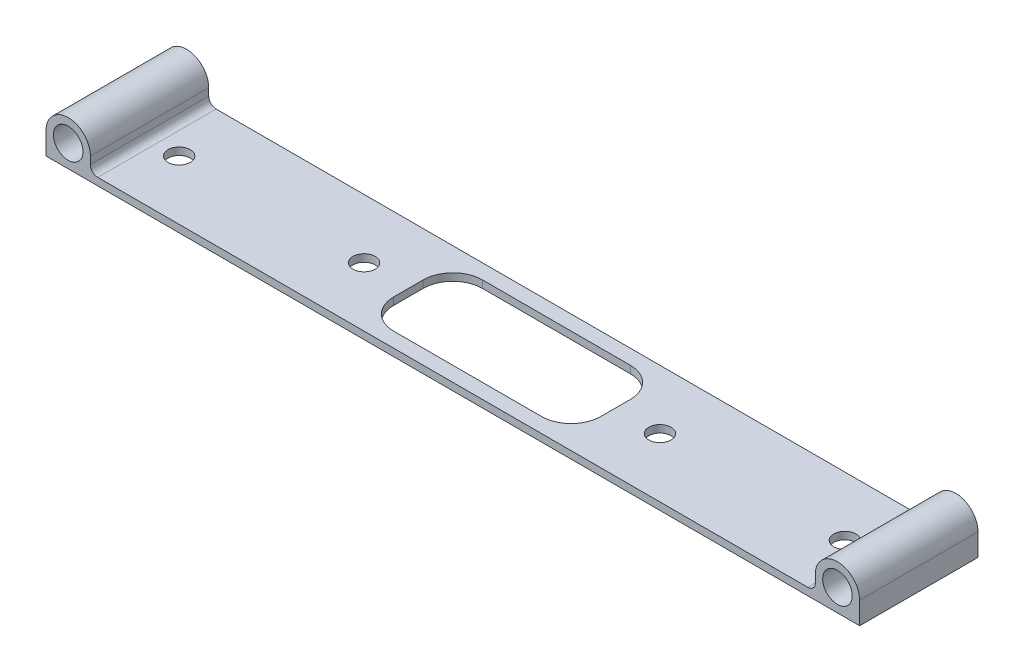
ISO-10303-21;
HEADER;
FILE_DESCRIPTION(('STEP AP214'),'2;1');
FILE_NAME('part.step','',(''),(''),'','','');
FILE_SCHEMA(('AUTOMOTIVE_DESIGN { 1 0 10303 214 1 1 1 1 }'));
ENDSEC;
DATA;
#1=APPLICATION_CONTEXT('core data for automotive mechanical design processes');
#2=APPLICATION_PROTOCOL_DEFINITION('international standard','automotive_design',2000,#1);
#3=PRODUCT_CONTEXT('',#1,'mechanical');
#4=PRODUCT('Part','Part','',(#3));
#5=PRODUCT_RELATED_PRODUCT_CATEGORY('part','',(#4));
#6=PRODUCT_DEFINITION_FORMATION('','',#4);
#7=PRODUCT_DEFINITION_CONTEXT('part definition',#1,'design');
#8=PRODUCT_DEFINITION('design','',#6,#7);
#9=PRODUCT_DEFINITION_SHAPE('','',#8);
#10=(LENGTH_UNIT() NAMED_UNIT(*) SI_UNIT(.MILLI.,.METRE.));
#11=(NAMED_UNIT(*) PLANE_ANGLE_UNIT() SI_UNIT($,.RADIAN.));
#12=(NAMED_UNIT(*) SI_UNIT($,.STERADIAN.) SOLID_ANGLE_UNIT());
#13=UNCERTAINTY_MEASURE_WITH_UNIT(LENGTH_MEASURE(1.E-05),#10,'distance_accuracy_value','');
#14=(GEOMETRIC_REPRESENTATION_CONTEXT(3) GLOBAL_UNCERTAINTY_ASSIGNED_CONTEXT((#13)) GLOBAL_UNIT_ASSIGNED_CONTEXT((#10,
#11,#12)) REPRESENTATION_CONTEXT('',''));
#15=CARTESIAN_POINT('',(0.,0.,0.));
#16=DIRECTION('',(0.,0.,1.));
#17=DIRECTION('',(1.,0.,0.));
#18=AXIS2_PLACEMENT_3D('',#15,#16,#17);
#19=CARTESIAN_POINT('',(-9.525,0.,50.8));
#20=DIRECTION('',(1.,0.,0.));
#21=DIRECTION('',(0.,1.,0.));
#22=AXIS2_PLACEMENT_3D('',#19,#20,#21);
#23=PLANE('',#22);
#24=DIRECTION('',(0.,-1.,0.));
#25=VECTOR('',#24,1.);
#26=CARTESIAN_POINT('',(-9.525,0.,0.));
#27=LINE('',#26,#25);
#28=CARTESIAN_POINT('',(-9.525,0.,0.));
#29=VERTEX_POINT('',#28);
#30=CARTESIAN_POINT('',(-9.525,-9.525,0.));
#31=VERTEX_POINT('',#30);
#32=EDGE_CURVE('E264',#29,#31,#27,.T.);
#33=ORIENTED_EDGE('',*,*,#32,.T.);
#34=DIRECTION('',(0.,0.,-1.));
#35=VECTOR('',#34,1.);
#36=CARTESIAN_POINT('',(-9.525,-9.525,50.8));
#37=LINE('',#36,#35);
#38=CARTESIAN_POINT('',(-9.525,-9.525,50.8));
#39=VERTEX_POINT('',#38);
#40=EDGE_CURVE('E286',#39,#31,#37,.T.);
#41=ORIENTED_EDGE('',*,*,#40,.F.);
#42=DIRECTION('',(0.,-1.,0.));
#43=VECTOR('',#42,1.);
#44=CARTESIAN_POINT('',(-9.525,0.,50.8));
#45=LINE('',#44,#43);
#46=CARTESIAN_POINT('',(-9.525,0.,50.8));
#47=VERTEX_POINT('',#46);
#48=EDGE_CURVE('E242',#47,#39,#45,.T.);
#49=ORIENTED_EDGE('',*,*,#48,.F.);
#50=DIRECTION('',(0.,0.,-1.));
#51=VECTOR('',#50,1.);
#52=CARTESIAN_POINT('',(-9.525,0.,50.8));
#53=LINE('',#52,#51);
#54=EDGE_CURVE('E260',#47,#29,#53,.T.);
#55=ORIENTED_EDGE('',*,*,#54,.T.);
#56=EDGE_LOOP('',(#33,#41,#49,#55));
#57=FACE_BOUND('',#56,.T.);
#58=ADVANCED_FACE('F41',(#57),#23,.F.);
#59=CARTESIAN_POINT('',(0.,-9.52500000000001,50.8));
#60=DIRECTION('',(0.,1.,0.));
#61=DIRECTION('',(-1.,0.,0.));
#62=AXIS2_PLACEMENT_3D('',#59,#60,#61);
#63=PLANE('',#62);
#64=DIRECTION('',(1.,0.,0.));
#65=VECTOR('',#64,1.);
#66=CARTESIAN_POINT('',(0.,-9.52500000000029,6.35));
#67=LINE('',#66,#65);
#68=CARTESIAN_POINT('',(133.35,-9.52500000000029,6.35));
#69=VERTEX_POINT('',#68);
#70=CARTESIAN_POINT('',(196.85,-9.52500000000029,6.35));
#71=VERTEX_POINT('',#70);
#72=EDGE_CURVE('E731',#69,#71,#67,.T.);
#73=ORIENTED_EDGE('',*,*,#72,.F.);
#74=CARTESIAN_POINT('',(133.35,-9.52500000000013,19.05));
#75=DIRECTION('',(0.,1.,0.));
#76=DIRECTION('',(-1.,0.,0.));
#77=AXIS2_PLACEMENT_3D('',#74,#75,#76);
#78=CIRCLE('',#77,12.7);
#79=CARTESIAN_POINT('',(120.65,-9.52500000000029,19.05));
#80=VERTEX_POINT('',#79);
#81=EDGE_CURVE('E339',#69,#80,#78,.T.);
#82=ORIENTED_EDGE('',*,*,#81,.T.);
#83=DIRECTION('',(0.,0.,1.));
#84=VECTOR('',#83,1.);
#85=CARTESIAN_POINT('',(120.65,-9.52500000000029,0.));
#86=LINE('',#85,#84);
#87=CARTESIAN_POINT('',(120.65,-9.52500000000029,31.75));
#88=VERTEX_POINT('',#87);
#89=EDGE_CURVE('E737',#80,#88,#86,.T.);
#90=ORIENTED_EDGE('',*,*,#89,.T.);
#91=CARTESIAN_POINT('',(133.35,-9.52500000000013,31.75));
#92=DIRECTION('',(0.,1.,0.));
#93=DIRECTION('',(-1.,0.,0.));
#94=AXIS2_PLACEMENT_3D('',#91,#92,#93);
#95=CIRCLE('',#94,12.7);
#96=CARTESIAN_POINT('',(133.35,-9.52500000000029,44.45));
#97=VERTEX_POINT('',#96);
#98=EDGE_CURVE('E333',#88,#97,#95,.T.);
#99=ORIENTED_EDGE('',*,*,#98,.T.);
#100=DIRECTION('',(1.,0.,0.));
#101=VECTOR('',#100,1.);
#102=CARTESIAN_POINT('',(0.,-9.52500000000029,44.45));
#103=LINE('',#102,#101);
#104=CARTESIAN_POINT('',(196.85,-9.52500000000029,44.45));
#105=VERTEX_POINT('',#104);
#106=EDGE_CURVE('E757',#97,#105,#103,.T.);
#107=ORIENTED_EDGE('',*,*,#106,.T.);
#108=CARTESIAN_POINT('',(196.85,-9.52500000000019,31.75));
#109=DIRECTION('',(0.,1.,0.));
#110=DIRECTION('',(-1.,0.,0.));
#111=AXIS2_PLACEMENT_3D('',#108,#109,#110);
#112=CIRCLE('',#111,12.7);
#113=CARTESIAN_POINT('',(209.55,-9.52500000000029,31.75));
#114=VERTEX_POINT('',#113);
#115=EDGE_CURVE('E327',#105,#114,#112,.T.);
#116=ORIENTED_EDGE('',*,*,#115,.T.);
#117=DIRECTION('',(0.,0.,1.));
#118=VECTOR('',#117,1.);
#119=CARTESIAN_POINT('',(209.55,-9.52500000000029,0.));
#120=LINE('',#119,#118);
#121=CARTESIAN_POINT('',(209.55,-9.52500000000029,19.05));
#122=VERTEX_POINT('',#121);
#123=EDGE_CURVE('E753',#122,#114,#120,.T.);
#124=ORIENTED_EDGE('',*,*,#123,.F.);
#125=CARTESIAN_POINT('',(196.85,-9.52500000000019,19.05));
#126=DIRECTION('',(0.,1.,0.));
#127=DIRECTION('',(-1.,0.,0.));
#128=AXIS2_PLACEMENT_3D('',#125,#126,#127);
#129=CIRCLE('',#128,12.7);
#130=EDGE_CURVE('E321',#122,#71,#129,.T.);
#131=ORIENTED_EDGE('',*,*,#130,.T.);
#132=EDGE_LOOP('',(#73,#82,#90,#99,#107,#116,#124,#131));
#133=FACE_BOUND('',#132,.T.);
#134=CARTESIAN_POINT('',(307.975,-9.52500000000029,25.4));
#135=DIRECTION('',(0.,1.,0.));
#136=DIRECTION('',(-1.,0.,0.));
#137=AXIS2_PLACEMENT_3D('',#134,#135,#136);
#138=CIRCLE('',#137,4.76250000000001);
#139=CARTESIAN_POINT('',(303.2125,-9.52500000000029,25.4));
#140=VERTEX_POINT('',#139);
#141=EDGE_CURVE('E210',#140,#140,#138,.F.);
#142=ORIENTED_EDGE('',*,*,#141,.F.);
#143=EDGE_LOOP('',(#142));
#144=FACE_BOUND('',#143,.T.);
#145=CARTESIAN_POINT('',(228.6,-9.52500000000022,25.4));
#146=DIRECTION('',(0.,1.,0.));
#147=DIRECTION('',(-1.,0.,0.));
#148=AXIS2_PLACEMENT_3D('',#145,#146,#147);
#149=CIRCLE('',#148,4.76250000000001);
#150=CARTESIAN_POINT('',(223.8375,-9.52500000000021,25.4));
#151=VERTEX_POINT('',#150);
#152=EDGE_CURVE('E719',#151,#151,#149,.F.);
#153=ORIENTED_EDGE('',*,*,#152,.F.);
#154=EDGE_LOOP('',(#153));
#155=FACE_BOUND('',#154,.T.);
#156=CARTESIAN_POINT('',(22.225,-9.52500000000003,25.4));
#157=DIRECTION('',(0.,1.,0.));
#158=DIRECTION('',(-1.,0.,0.));
#159=AXIS2_PLACEMENT_3D('',#156,#157,#158);
#160=CIRCLE('',#159,4.76250000000001);
#161=CARTESIAN_POINT('',(17.4625,-9.52500000000003,25.4));
#162=VERTEX_POINT('',#161);
#163=EDGE_CURVE('E233',#162,#162,#160,.T.);
#164=ORIENTED_EDGE('',*,*,#163,.T.);
#165=EDGE_LOOP('',(#164));
#166=FACE_BOUND('',#165,.T.);
#167=CARTESIAN_POINT('',(101.6,-9.5250000000001,25.4));
#168=DIRECTION('',(0.,1.,0.));
#169=DIRECTION('',(-1.,0.,0.));
#170=AXIS2_PLACEMENT_3D('',#167,#168,#169);
#171=CIRCLE('',#170,4.76250000000001);
#172=CARTESIAN_POINT('',(96.8375,-9.5250000000001,25.4));
#173=VERTEX_POINT('',#172);
#174=EDGE_CURVE('E226',#173,#173,#171,.T.);
#175=ORIENTED_EDGE('',*,*,#174,.T.);
#176=EDGE_LOOP('',(#175));
#177=FACE_BOUND('',#176,.T.);
#178=DIRECTION('',(1.,0.,0.));
#179=VECTOR('',#178,1.);
#180=CARTESIAN_POINT('',(0.,-9.52500000000001,0.));
#181=LINE('',#180,#179);
#182=CARTESIAN_POINT('',(339.725,-9.525,0.));
#183=VERTEX_POINT('',#182);
#184=EDGE_CURVE('E268',#31,#183,#181,.T.);
#185=ORIENTED_EDGE('',*,*,#184,.T.);
#186=DIRECTION('',(0.,0.,-1.));
#187=VECTOR('',#186,1.);
#188=CARTESIAN_POINT('',(339.725,-9.525,50.8));
#189=LINE('',#188,#187);
#190=CARTESIAN_POINT('',(339.725,-9.525,50.8));
#191=VERTEX_POINT('',#190);
#192=EDGE_CURVE('E205',#191,#183,#189,.T.);
#193=ORIENTED_EDGE('',*,*,#192,.F.);
#194=DIRECTION('',(1.,0.,0.));
#195=VECTOR('',#194,1.);
#196=CARTESIAN_POINT('',(0.,-9.52500000000001,50.8));
#197=LINE('',#196,#195);
#198=EDGE_CURVE('E192',#39,#191,#197,.T.);
#199=ORIENTED_EDGE('',*,*,#198,.F.);
#200=ORIENTED_EDGE('',*,*,#40,.T.);
#201=EDGE_LOOP('',(#185,#193,#199,#200));
#202=FACE_BOUND('',#201,.T.);
#203=ADVANCED_FACE('F385',(#133,#144,#155,#166,#177,#202),#63,.F.);
#204=CARTESIAN_POINT('',(0.,-6.35,50.8));
#205=DIRECTION('',(0.,1.,0.));
#206=DIRECTION('',(-1.,0.,0.));
#207=AXIS2_PLACEMENT_3D('',#204,#205,#206);
#208=PLANE('',#207);
#209=DIRECTION('',(0.,0.,1.));
#210=VECTOR('',#209,1.);
#211=CARTESIAN_POINT('',(120.65,-6.35,0.));
#212=LINE('',#211,#210);
#213=CARTESIAN_POINT('',(120.65,-6.35,19.05));
#214=VERTEX_POINT('',#213);
#215=CARTESIAN_POINT('',(120.65,-6.35,31.75));
#216=VERTEX_POINT('',#215);
#217=EDGE_CURVE('E746',#214,#216,#212,.T.);
#218=ORIENTED_EDGE('',*,*,#217,.F.);
#219=CARTESIAN_POINT('',(133.35,-6.35,19.05));
#220=DIRECTION('',(0.,1.,0.));
#221=DIRECTION('',(-1.,0.,0.));
#222=AXIS2_PLACEMENT_3D('',#219,#220,#221);
#223=CIRCLE('',#222,12.7);
#224=CARTESIAN_POINT('',(133.35,-6.35,6.35));
#225=VERTEX_POINT('',#224);
#226=EDGE_CURVE('E336',#214,#225,#223,.F.);
#227=ORIENTED_EDGE('',*,*,#226,.T.);
#228=DIRECTION('',(1.,0.,0.));
#229=VECTOR('',#228,1.);
#230=CARTESIAN_POINT('',(0.,-6.35,6.35));
#231=LINE('',#230,#229);
#232=CARTESIAN_POINT('',(196.85,-6.35,6.35));
#233=VERTEX_POINT('',#232);
#234=EDGE_CURVE('E733',#225,#233,#231,.T.);
#235=ORIENTED_EDGE('',*,*,#234,.T.);
#236=CARTESIAN_POINT('',(196.85,-6.35,19.05));
#237=DIRECTION('',(0.,1.,0.));
#238=DIRECTION('',(-1.,0.,0.));
#239=AXIS2_PLACEMENT_3D('',#236,#237,#238);
#240=CIRCLE('',#239,12.7);
#241=CARTESIAN_POINT('',(209.55,-6.35,19.05));
#242=VERTEX_POINT('',#241);
#243=EDGE_CURVE('E318',#233,#242,#240,.F.);
#244=ORIENTED_EDGE('',*,*,#243,.T.);
#245=DIRECTION('',(0.,0.,1.));
#246=VECTOR('',#245,1.);
#247=CARTESIAN_POINT('',(209.55,-6.35,0.));
#248=LINE('',#247,#246);
#249=CARTESIAN_POINT('',(209.55,-6.35,31.75));
#250=VERTEX_POINT('',#249);
#251=EDGE_CURVE('E738',#242,#250,#248,.T.);
#252=ORIENTED_EDGE('',*,*,#251,.T.);
#253=CARTESIAN_POINT('',(196.85,-6.35,31.75));
#254=DIRECTION('',(0.,1.,0.));
#255=DIRECTION('',(-1.,0.,0.));
#256=AXIS2_PLACEMENT_3D('',#253,#254,#255);
#257=CIRCLE('',#256,12.7);
#258=CARTESIAN_POINT('',(196.85,-6.35,44.45));
#259=VERTEX_POINT('',#258);
#260=EDGE_CURVE('E324',#250,#259,#257,.F.);
#261=ORIENTED_EDGE('',*,*,#260,.T.);
#262=DIRECTION('',(1.,0.,0.));
#263=VECTOR('',#262,1.);
#264=CARTESIAN_POINT('',(0.,-6.35,44.45));
#265=LINE('',#264,#263);
#266=CARTESIAN_POINT('',(133.35,-6.35,44.45));
#267=VERTEX_POINT('',#266);
#268=EDGE_CURVE('E742',#267,#259,#265,.T.);
#269=ORIENTED_EDGE('',*,*,#268,.F.);
#270=CARTESIAN_POINT('',(133.35,-6.35,31.75));
#271=DIRECTION('',(0.,1.,0.));
#272=DIRECTION('',(-1.,0.,0.));
#273=AXIS2_PLACEMENT_3D('',#270,#271,#272);
#274=CIRCLE('',#273,12.7);
#275=EDGE_CURVE('E330',#267,#216,#274,.F.);
#276=ORIENTED_EDGE('',*,*,#275,.T.);
#277=EDGE_LOOP('',(#218,#227,#235,#244,#252,#261,#269,#276));
#278=FACE_BOUND('',#277,.T.);
#279=CARTESIAN_POINT('',(307.975,-6.35,25.4));
#280=DIRECTION('',(0.,-1.,0.));
#281=DIRECTION('',(1.,0.,0.));
#282=AXIS2_PLACEMENT_3D('',#279,#280,#281);
#283=CIRCLE('',#282,4.76250000000001);
#284=CARTESIAN_POINT('',(312.7375,-6.35,25.4));
#285=VERTEX_POINT('',#284);
#286=EDGE_CURVE('E722',#285,#285,#283,.T.);
#287=ORIENTED_EDGE('',*,*,#286,.T.);
#288=EDGE_LOOP('',(#287));
#289=FACE_BOUND('',#288,.T.);
#290=CARTESIAN_POINT('',(228.6,-6.35000000000001,25.4));
#291=DIRECTION('',(0.,-1.,0.));
#292=DIRECTION('',(1.,0.,0.));
#293=AXIS2_PLACEMENT_3D('',#290,#291,#292);
#294=CIRCLE('',#293,4.76250000000001);
#295=CARTESIAN_POINT('',(233.3625,-6.35000000000001,25.4));
#296=VERTEX_POINT('',#295);
#297=EDGE_CURVE('E716',#296,#296,#294,.T.);
#298=ORIENTED_EDGE('',*,*,#297,.T.);
#299=EDGE_LOOP('',(#298));
#300=FACE_BOUND('',#299,.T.);
#301=CARTESIAN_POINT('',(22.225,-6.35,25.4));
#302=DIRECTION('',(0.,1.,0.));
#303=DIRECTION('',(-1.,0.,0.));
#304=AXIS2_PLACEMENT_3D('',#301,#302,#303);
#305=CIRCLE('',#304,4.76250000000001);
#306=CARTESIAN_POINT('',(17.4625,-6.35,25.4));
#307=VERTEX_POINT('',#306);
#308=EDGE_CURVE('E222',#307,#307,#305,.T.);
#309=ORIENTED_EDGE('',*,*,#308,.F.);
#310=EDGE_LOOP('',(#309));
#311=FACE_BOUND('',#310,.T.);
#312=CARTESIAN_POINT('',(101.6,-6.35000000000001,25.4));
#313=DIRECTION('',(0.,1.,0.));
#314=DIRECTION('',(-1.,0.,0.));
#315=AXIS2_PLACEMENT_3D('',#312,#313,#314);
#316=CIRCLE('',#315,4.76250000000001);
#317=CARTESIAN_POINT('',(96.8375,-6.35000000000001,25.4));
#318=VERTEX_POINT('',#317);
#319=EDGE_CURVE('E177',#318,#318,#316,.T.);
#320=ORIENTED_EDGE('',*,*,#319,.F.);
#321=EDGE_LOOP('',(#320));
#322=FACE_BOUND('',#321,.T.);
#323=DIRECTION('',(1.,0.,0.));
#324=VECTOR('',#323,1.);
#325=CARTESIAN_POINT('',(0.,-6.35,0.));
#326=LINE('',#325,#324);
#327=CARTESIAN_POINT('',(12.7,-6.35,0.));
#328=VERTEX_POINT('',#327);
#329=CARTESIAN_POINT('',(317.5,-6.35,0.));
#330=VERTEX_POINT('',#329);
#331=EDGE_CURVE('E271',#328,#330,#326,.T.);
#332=ORIENTED_EDGE('',*,*,#331,.F.);
#333=DIRECTION('',(0.,0.,-1.));
#334=VECTOR('',#333,1.);
#335=CARTESIAN_POINT('',(12.7,-6.35,50.8));
#336=LINE('',#335,#334);
#337=CARTESIAN_POINT('',(12.7,-6.35,50.8));
#338=VERTEX_POINT('',#337);
#339=EDGE_CURVE('E350',#328,#338,#336,.F.);
#340=ORIENTED_EDGE('',*,*,#339,.T.);
#341=DIRECTION('',(1.,0.,0.));
#342=VECTOR('',#341,1.);
#343=CARTESIAN_POINT('',(0.,-6.35,50.8));
#344=LINE('',#343,#342);
#345=CARTESIAN_POINT('',(317.5,-6.35,50.8));
#346=VERTEX_POINT('',#345);
#347=EDGE_CURVE('E248',#338,#346,#344,.T.);
#348=ORIENTED_EDGE('',*,*,#347,.T.);
#349=DIRECTION('',(0.,0.,-1.));
#350=VECTOR('',#349,1.);
#351=CARTESIAN_POINT('',(317.5,-6.35,50.8));
#352=LINE('',#351,#350);
#353=EDGE_CURVE('E346',#346,#330,#352,.T.);
#354=ORIENTED_EDGE('',*,*,#353,.T.);
#355=EDGE_LOOP('',(#332,#340,#348,#354));
#356=FACE_BOUND('',#355,.T.);
#357=ADVANCED_FACE('F377',(#278,#289,#300,#311,#322,#356),#208,.T.);
#358=CARTESIAN_POINT('',(9.525,0.,50.8));
#359=DIRECTION('',(1.,0.,0.));
#360=DIRECTION('',(0.,0.,-1.));
#361=AXIS2_PLACEMENT_3D('',#358,#359,#360);
#362=PLANE('',#361);
#363=DIRECTION('',(0.,-1.,0.));
#364=VECTOR('',#363,1.);
#365=CARTESIAN_POINT('',(9.525,0.,50.8));
#366=LINE('',#365,#364);
#367=CARTESIAN_POINT('',(9.525,0.,50.8));
#368=VERTEX_POINT('',#367);
#369=CARTESIAN_POINT('',(9.525,-3.175,50.8));
#370=VERTEX_POINT('',#369);
#371=EDGE_CURVE('E252',#368,#370,#366,.T.);
#372=ORIENTED_EDGE('',*,*,#371,.T.);
#373=DIRECTION('',(0.,0.,-1.));
#374=VECTOR('',#373,1.);
#375=CARTESIAN_POINT('',(9.525,-3.175,0.));
#376=LINE('',#375,#374);
#377=CARTESIAN_POINT('',(9.525,-3.175,0.));
#378=VERTEX_POINT('',#377);
#379=EDGE_CURVE('E342',#370,#378,#376,.T.);
#380=ORIENTED_EDGE('',*,*,#379,.T.);
#381=DIRECTION('',(0.,-1.,0.));
#382=VECTOR('',#381,1.);
#383=CARTESIAN_POINT('',(9.525,0.,0.));
#384=LINE('',#383,#382);
#385=CARTESIAN_POINT('',(9.525,0.,0.));
#386=VERTEX_POINT('',#385);
#387=EDGE_CURVE('E274',#386,#378,#384,.T.);
#388=ORIENTED_EDGE('',*,*,#387,.F.);
#389=DIRECTION('',(0.,0.,-1.));
#390=VECTOR('',#389,1.);
#391=CARTESIAN_POINT('',(9.525,0.,50.8));
#392=LINE('',#391,#390);
#393=EDGE_CURVE('E283',#368,#386,#392,.T.);
#394=ORIENTED_EDGE('',*,*,#393,.F.);
#395=EDGE_LOOP('',(#372,#380,#388,#394));
#396=FACE_BOUND('',#395,.T.);
#397=ADVANCED_FACE('F369',(#396),#362,.T.);
#398=CARTESIAN_POINT('',(0.,0.,50.8));
#399=DIRECTION('',(0.,0.,-1.));
#400=DIRECTION('',(-1.,0.,0.));
#401=AXIS2_PLACEMENT_3D('',#398,#399,#400);
#402=CYLINDRICAL_SURFACE('',#401,6.35);
#403=CARTESIAN_POINT('',(0.,0.,50.8));
#404=DIRECTION('',(0.,0.,1.));
#405=DIRECTION('',(1.,0.,0.));
#406=AXIS2_PLACEMENT_3D('',#403,#404,#405);
#407=CIRCLE('',#406,6.35);
#408=CARTESIAN_POINT('',(6.34999999999999,0.,50.8));
#409=VERTEX_POINT('',#408);
#410=EDGE_CURVE('E238',#409,#409,#407,.T.);
#411=ORIENTED_EDGE('',*,*,#410,.T.);
#412=EDGE_LOOP('',(#411));
#413=FACE_BOUND('',#412,.T.);
#414=CARTESIAN_POINT('',(0.,0.,0.));
#415=DIRECTION('',(0.,0.,1.));
#416=DIRECTION('',(1.,0.,0.));
#417=AXIS2_PLACEMENT_3D('',#414,#415,#416);
#418=CIRCLE('',#417,6.35);
#419=CARTESIAN_POINT('',(6.34999999999999,0.,0.));
#420=VERTEX_POINT('',#419);
#421=EDGE_CURVE('E237',#420,#420,#418,.T.);
#422=ORIENTED_EDGE('',*,*,#421,.F.);
#423=EDGE_LOOP('',(#422));
#424=FACE_BOUND('',#423,.T.);
#425=ADVANCED_FACE('F391',(#413,#424),#402,.F.);
#426=CARTESIAN_POINT('',(0.,0.,50.8));
#427=DIRECTION('',(0.,0.,-1.));
#428=DIRECTION('',(-1.,0.,0.));
#429=AXIS2_PLACEMENT_3D('',#426,#427,#428);
#430=CYLINDRICAL_SURFACE('',#429,9.525);
#431=CARTESIAN_POINT('',(0.,0.,0.));
#432=DIRECTION('',(0.,0.,1.));
#433=DIRECTION('',(1.,0.,0.));
#434=AXIS2_PLACEMENT_3D('',#431,#432,#433);
#435=CIRCLE('',#434,9.525);
#436=EDGE_CURVE('E243',#29,#386,#435,.F.);
#437=ORIENTED_EDGE('',*,*,#436,.F.);
#438=ORIENTED_EDGE('',*,*,#54,.F.);
#439=CARTESIAN_POINT('',(0.,0.,50.8));
#440=DIRECTION('',(0.,0.,1.));
#441=DIRECTION('',(1.,0.,0.));
#442=AXIS2_PLACEMENT_3D('',#439,#440,#441);
#443=CIRCLE('',#442,9.525);
#444=EDGE_CURVE('E256',#47,#368,#443,.F.);
#445=ORIENTED_EDGE('',*,*,#444,.T.);
#446=ORIENTED_EDGE('',*,*,#393,.T.);
#447=EDGE_LOOP('',(#437,#438,#445,#446));
#448=FACE_BOUND('',#447,.T.);
#449=ADVANCED_FACE('F389',(#448),#430,.T.);
#450=CARTESIAN_POINT('',(0.,0.,50.8));
#451=DIRECTION('',(0.,0.,1.));
#452=DIRECTION('',(1.,0.,0.));
#453=AXIS2_PLACEMENT_3D('',#450,#451,#452);
#454=PLANE('',#453);
#455=ORIENTED_EDGE('',*,*,#410,.F.);
#456=EDGE_LOOP('',(#455));
#457=FACE_BOUND('',#456,.T.);
#458=ORIENTED_EDGE('',*,*,#48,.T.);
#459=ORIENTED_EDGE('',*,*,#198,.T.);
#460=DIRECTION('',(0.,-1.,0.));
#461=VECTOR('',#460,1.);
#462=CARTESIAN_POINT('',(339.725,0.,50.8));
#463=LINE('',#462,#461);
#464=CARTESIAN_POINT('',(339.725,0.,50.8));
#465=VERTEX_POINT('',#464);
#466=EDGE_CURVE('E170',#465,#191,#463,.T.);
#467=ORIENTED_EDGE('',*,*,#466,.F.);
#468=CARTESIAN_POINT('',(330.2,0.,50.8));
#469=DIRECTION('',(0.,0.,-1.));
#470=DIRECTION('',(-1.,0.,0.));
#471=AXIS2_PLACEMENT_3D('',#468,#469,#470);
#472=CIRCLE('',#471,9.525);
#473=CARTESIAN_POINT('',(320.675,0.,50.8));
#474=VERTEX_POINT('',#473);
#475=EDGE_CURVE('E182',#465,#474,#472,.F.);
#476=ORIENTED_EDGE('',*,*,#475,.T.);
#477=DIRECTION('',(0.,-1.,0.));
#478=VECTOR('',#477,1.);
#479=CARTESIAN_POINT('',(320.675,0.,50.8));
#480=LINE('',#479,#478);
#481=CARTESIAN_POINT('',(320.675,-3.175,50.8));
#482=VERTEX_POINT('',#481);
#483=EDGE_CURVE('E187',#474,#482,#480,.T.);
#484=ORIENTED_EDGE('',*,*,#483,.T.);
#485=CARTESIAN_POINT('',(317.5,-3.175,50.8));
#486=DIRECTION('',(0.,0.,1.));
#487=DIRECTION('',(1.,0.,0.));
#488=AXIS2_PLACEMENT_3D('',#485,#486,#487);
#489=CIRCLE('',#488,3.175);
#490=EDGE_CURVE('E11',#482,#346,#489,.F.);
#491=ORIENTED_EDGE('',*,*,#490,.T.);
#492=ORIENTED_EDGE('',*,*,#347,.F.);
#493=CARTESIAN_POINT('',(12.7,-3.175,50.8));
#494=DIRECTION('',(0.,0.,1.));
#495=DIRECTION('',(1.,0.,0.));
#496=AXIS2_PLACEMENT_3D('',#493,#494,#495);
#497=CIRCLE('',#496,3.175);
#498=EDGE_CURVE('E358',#338,#370,#497,.F.);
#499=ORIENTED_EDGE('',*,*,#498,.T.);
#500=ORIENTED_EDGE('',*,*,#371,.F.);
#501=ORIENTED_EDGE('',*,*,#444,.F.);
#502=EDGE_LOOP('',(#458,#459,#467,#476,#484,#491,#492,#499,#500,#501));
#503=FACE_BOUND('',#502,.T.);
#504=CARTESIAN_POINT('',(330.2,0.,50.8));
#505=DIRECTION('',(0.,0.,-1.));
#506=DIRECTION('',(-1.,0.,0.));
#507=AXIS2_PLACEMENT_3D('',#504,#505,#506);
#508=CIRCLE('',#507,6.35);
#509=CARTESIAN_POINT('',(323.85,0.,50.8));
#510=VERTEX_POINT('',#509);
#511=EDGE_CURVE('E195',#510,#510,#508,.T.);
#512=ORIENTED_EDGE('',*,*,#511,.T.);
#513=EDGE_LOOP('',(#512));
#514=FACE_BOUND('',#513,.T.);
#515=ADVANCED_FACE('F190',(#457,#503,#514),#454,.T.);
#516=CARTESIAN_POINT('',(0.,0.,0.));
#517=DIRECTION('',(0.,0.,1.));
#518=DIRECTION('',(1.,0.,0.));
#519=AXIS2_PLACEMENT_3D('',#516,#517,#518);
#520=PLANE('',#519);
#521=ORIENTED_EDGE('',*,*,#421,.T.);
#522=EDGE_LOOP('',(#521));
#523=FACE_BOUND('',#522,.T.);
#524=ORIENTED_EDGE('',*,*,#32,.F.);
#525=ORIENTED_EDGE('',*,*,#436,.T.);
#526=ORIENTED_EDGE('',*,*,#387,.T.);
#527=CARTESIAN_POINT('',(12.7,-3.175,0.));
#528=DIRECTION('',(0.,0.,1.));
#529=DIRECTION('',(1.,0.,0.));
#530=AXIS2_PLACEMENT_3D('',#527,#528,#529);
#531=CIRCLE('',#530,3.175);
#532=EDGE_CURVE('E355',#378,#328,#531,.T.);
#533=ORIENTED_EDGE('',*,*,#532,.T.);
#534=ORIENTED_EDGE('',*,*,#331,.T.);
#535=CARTESIAN_POINT('',(317.5,-3.175,0.));
#536=DIRECTION('',(0.,0.,1.));
#537=DIRECTION('',(1.,0.,0.));
#538=AXIS2_PLACEMENT_3D('',#535,#536,#537);
#539=CIRCLE('',#538,3.175);
#540=CARTESIAN_POINT('',(320.675,-3.175,0.));
#541=VERTEX_POINT('',#540);
#542=EDGE_CURVE('E50',#330,#541,#539,.T.);
#543=ORIENTED_EDGE('',*,*,#542,.T.);
#544=DIRECTION('',(0.,-1.,0.));
#545=VECTOR('',#544,1.);
#546=CARTESIAN_POINT('',(320.675,0.,0.));
#547=LINE('',#546,#545);
#548=CARTESIAN_POINT('',(320.675,0.,0.));
#549=VERTEX_POINT('',#548);
#550=EDGE_CURVE('E199',#549,#541,#547,.T.);
#551=ORIENTED_EDGE('',*,*,#550,.F.);
#552=CARTESIAN_POINT('',(330.2,0.,0.));
#553=DIRECTION('',(0.,0.,-1.));
#554=DIRECTION('',(-1.,0.,0.));
#555=AXIS2_PLACEMENT_3D('',#552,#553,#554);
#556=CIRCLE('',#555,9.525);
#557=CARTESIAN_POINT('',(339.725,0.,0.));
#558=VERTEX_POINT('',#557);
#559=EDGE_CURVE('E213',#558,#549,#556,.F.);
#560=ORIENTED_EDGE('',*,*,#559,.F.);
#561=DIRECTION('',(0.,-1.,0.));
#562=VECTOR('',#561,1.);
#563=CARTESIAN_POINT('',(339.725,0.,0.));
#564=LINE('',#563,#562);
#565=EDGE_CURVE('E172',#558,#183,#564,.T.);
#566=ORIENTED_EDGE('',*,*,#565,.T.);
#567=ORIENTED_EDGE('',*,*,#184,.F.);
#568=EDGE_LOOP('',(#524,#525,#526,#533,#534,#543,#551,#560,#566,#567));
#569=FACE_BOUND('',#568,.T.);
#570=CARTESIAN_POINT('',(330.2,0.,0.));
#571=DIRECTION('',(0.,0.,-1.));
#572=DIRECTION('',(-1.,0.,0.));
#573=AXIS2_PLACEMENT_3D('',#570,#571,#572);
#574=CIRCLE('',#573,6.35);
#575=CARTESIAN_POINT('',(323.85,0.,0.));
#576=VERTEX_POINT('',#575);
#577=EDGE_CURVE('E206',#576,#576,#574,.T.);
#578=ORIENTED_EDGE('',*,*,#577,.F.);
#579=EDGE_LOOP('',(#578));
#580=FACE_BOUND('',#579,.T.);
#581=ADVANCED_FACE('F374',(#523,#569,#580),#520,.F.);
#582=CARTESIAN_POINT('',(101.6,-19.05,25.4));
#583=DIRECTION('',(0.,1.,0.));
#584=DIRECTION('',(-1.,0.,0.));
#585=AXIS2_PLACEMENT_3D('',#582,#583,#584);
#586=CYLINDRICAL_SURFACE('',#585,4.76250000000001);
#587=ORIENTED_EDGE('',*,*,#319,.T.);
#588=EDGE_LOOP('',(#587));
#589=FACE_BOUND('',#588,.T.);
#590=ORIENTED_EDGE('',*,*,#174,.F.);
#591=EDGE_LOOP('',(#590));
#592=FACE_BOUND('',#591,.T.);
#593=ADVANCED_FACE('F461',(#589,#592),#586,.F.);
#594=CARTESIAN_POINT('',(22.225,-19.05,25.4));
#595=DIRECTION('',(0.,1.,0.));
#596=DIRECTION('',(-1.,0.,0.));
#597=AXIS2_PLACEMENT_3D('',#594,#595,#596);
#598=CYLINDRICAL_SURFACE('',#597,4.76250000000001);
#599=ORIENTED_EDGE('',*,*,#308,.T.);
#600=EDGE_LOOP('',(#599));
#601=FACE_BOUND('',#600,.T.);
#602=ORIENTED_EDGE('',*,*,#163,.F.);
#603=EDGE_LOOP('',(#602));
#604=FACE_BOUND('',#603,.T.);
#605=ADVANCED_FACE('F601',(#601,#604),#598,.F.);
#606=CARTESIAN_POINT('',(339.725,0.,50.8));
#607=DIRECTION('',(1.,0.,0.));
#608=DIRECTION('',(0.,1.,0.));
#609=AXIS2_PLACEMENT_3D('',#606,#607,#608);
#610=PLANE('',#609);
#611=ORIENTED_EDGE('',*,*,#565,.F.);
#612=DIRECTION('',(0.,0.,-1.));
#613=VECTOR('',#612,1.);
#614=CARTESIAN_POINT('',(339.725,0.,50.8));
#615=LINE('',#614,#613);
#616=EDGE_CURVE('E165',#465,#558,#615,.T.);
#617=ORIENTED_EDGE('',*,*,#616,.F.);
#618=ORIENTED_EDGE('',*,*,#466,.T.);
#619=ORIENTED_EDGE('',*,*,#192,.T.);
#620=EDGE_LOOP('',(#611,#617,#618,#619));
#621=FACE_BOUND('',#620,.T.);
#622=ADVANCED_FACE('F167',(#621),#610,.T.);
#623=CARTESIAN_POINT('',(330.2,0.,50.8));
#624=DIRECTION('',(0.,0.,-1.));
#625=DIRECTION('',(-1.,0.,0.));
#626=AXIS2_PLACEMENT_3D('',#623,#624,#625);
#627=CYLINDRICAL_SURFACE('',#626,9.525);
#628=ORIENTED_EDGE('',*,*,#559,.T.);
#629=DIRECTION('',(0.,0.,-1.));
#630=VECTOR('',#629,1.);
#631=CARTESIAN_POINT('',(320.675,0.,50.8));
#632=LINE('',#631,#630);
#633=EDGE_CURVE('E178',#474,#549,#632,.T.);
#634=ORIENTED_EDGE('',*,*,#633,.F.);
#635=ORIENTED_EDGE('',*,*,#475,.F.);
#636=ORIENTED_EDGE('',*,*,#616,.T.);
#637=EDGE_LOOP('',(#628,#634,#635,#636));
#638=FACE_BOUND('',#637,.T.);
#639=ADVANCED_FACE('F183',(#638),#627,.T.);
#640=CARTESIAN_POINT('',(320.675,0.,50.8));
#641=DIRECTION('',(1.,0.,0.));
#642=DIRECTION('',(0.,0.,-1.));
#643=AXIS2_PLACEMENT_3D('',#640,#641,#642);
#644=PLANE('',#643);
#645=ORIENTED_EDGE('',*,*,#550,.T.);
#646=DIRECTION('',(0.,0.,-1.));
#647=VECTOR('',#646,1.);
#648=CARTESIAN_POINT('',(320.675,-3.175,50.8));
#649=LINE('',#648,#647);
#650=EDGE_CURVE('E57',#541,#482,#649,.F.);
#651=ORIENTED_EDGE('',*,*,#650,.T.);
#652=ORIENTED_EDGE('',*,*,#483,.F.);
#653=ORIENTED_EDGE('',*,*,#633,.T.);
#654=EDGE_LOOP('',(#645,#651,#652,#653));
#655=FACE_BOUND('',#654,.T.);
#656=ADVANCED_FACE('F381',(#655),#644,.F.);
#657=CARTESIAN_POINT('',(330.2,0.,50.8));
#658=DIRECTION('',(0.,0.,-1.));
#659=DIRECTION('',(-1.,0.,0.));
#660=AXIS2_PLACEMENT_3D('',#657,#658,#659);
#661=CYLINDRICAL_SURFACE('',#660,6.35);
#662=ORIENTED_EDGE('',*,*,#511,.F.);
#663=EDGE_LOOP('',(#662));
#664=FACE_BOUND('',#663,.T.);
#665=ORIENTED_EDGE('',*,*,#577,.T.);
#666=EDGE_LOOP('',(#665));
#667=FACE_BOUND('',#666,.T.);
#668=ADVANCED_FACE('F448',(#664,#667),#661,.F.);
#669=CARTESIAN_POINT('',(228.6,-19.05,25.4));
#670=DIRECTION('',(0.,1.,0.));
#671=DIRECTION('',(-1.,0.,0.));
#672=AXIS2_PLACEMENT_3D('',#669,#670,#671);
#673=CYLINDRICAL_SURFACE('',#672,4.76250000000001);
#674=ORIENTED_EDGE('',*,*,#297,.F.);
#675=EDGE_LOOP('',(#674));
#676=FACE_BOUND('',#675,.T.);
#677=ORIENTED_EDGE('',*,*,#152,.T.);
#678=EDGE_LOOP('',(#677));
#679=FACE_BOUND('',#678,.T.);
#680=ADVANCED_FACE('F569',(#676,#679),#673,.F.);
#681=CARTESIAN_POINT('',(307.975,-19.05,25.4));
#682=DIRECTION('',(0.,1.,0.));
#683=DIRECTION('',(-1.,0.,0.));
#684=AXIS2_PLACEMENT_3D('',#681,#682,#683);
#685=CYLINDRICAL_SURFACE('',#684,4.76250000000001);
#686=ORIENTED_EDGE('',*,*,#286,.F.);
#687=EDGE_LOOP('',(#686));
#688=FACE_BOUND('',#687,.T.);
#689=ORIENTED_EDGE('',*,*,#141,.T.);
#690=EDGE_LOOP('',(#689));
#691=FACE_BOUND('',#690,.T.);
#692=ADVANCED_FACE('F553',(#688,#691),#685,.F.);
#693=CARTESIAN_POINT('',(120.65,-9.52500000000029,0.));
#694=DIRECTION('',(-1.,0.,0.));
#695=DIRECTION('',(0.,0.,1.));
#696=AXIS2_PLACEMENT_3D('',#693,#694,#695);
#697=PLANE('',#696);
#698=ORIENTED_EDGE('',*,*,#217,.T.);
#699=DIRECTION('',(0.,1.,0.));
#700=VECTOR('',#699,1.);
#701=CARTESIAN_POINT('',(120.65,-9.52500000000029,31.75));
#702=LINE('',#701,#700);
#703=EDGE_CURVE('E315',#216,#88,#702,.F.);
#704=ORIENTED_EDGE('',*,*,#703,.T.);
#705=ORIENTED_EDGE('',*,*,#89,.F.);
#706=DIRECTION('',(0.,1.,0.));
#707=VECTOR('',#706,1.);
#708=CARTESIAN_POINT('',(120.65,-9.52500000000029,19.05));
#709=LINE('',#708,#707);
#710=EDGE_CURVE('E311',#80,#214,#709,.T.);
#711=ORIENTED_EDGE('',*,*,#710,.T.);
#712=EDGE_LOOP('',(#698,#704,#705,#711));
#713=FACE_BOUND('',#712,.T.);
#714=ADVANCED_FACE('F543',(#713),#697,.F.);
#715=CARTESIAN_POINT('',(0.,-9.52500000000029,6.35));
#716=DIRECTION('',(0.,0.,1.));
#717=DIRECTION('',(1.,0.,0.));
#718=AXIS2_PLACEMENT_3D('',#715,#716,#717);
#719=PLANE('',#718);
#720=ORIENTED_EDGE('',*,*,#72,.T.);
#721=DIRECTION('',(0.,1.,0.));
#722=VECTOR('',#721,1.);
#723=CARTESIAN_POINT('',(196.85,-6.35,6.35));
#724=LINE('',#723,#722);
#725=EDGE_CURVE('E293',#71,#233,#724,.T.);
#726=ORIENTED_EDGE('',*,*,#725,.T.);
#727=ORIENTED_EDGE('',*,*,#234,.F.);
#728=DIRECTION('',(0.,1.,0.));
#729=VECTOR('',#728,1.);
#730=CARTESIAN_POINT('',(133.35,-9.52500000000029,6.35));
#731=LINE('',#730,#729);
#732=EDGE_CURVE('E290',#225,#69,#731,.F.);
#733=ORIENTED_EDGE('',*,*,#732,.T.);
#734=EDGE_LOOP('',(#720,#726,#727,#733));
#735=FACE_BOUND('',#734,.T.);
#736=ADVANCED_FACE('F533',(#735),#719,.T.);
#737=CARTESIAN_POINT('',(209.55,-9.52500000000029,0.));
#738=DIRECTION('',(-1.,0.,0.));
#739=DIRECTION('',(0.,0.,1.));
#740=AXIS2_PLACEMENT_3D('',#737,#738,#739);
#741=PLANE('',#740);
#742=ORIENTED_EDGE('',*,*,#251,.F.);
#743=DIRECTION('',(0.,1.,0.));
#744=VECTOR('',#743,1.);
#745=CARTESIAN_POINT('',(209.55,-9.52500000000029,19.05));
#746=LINE('',#745,#744);
#747=EDGE_CURVE('E301',#242,#122,#746,.F.);
#748=ORIENTED_EDGE('',*,*,#747,.T.);
#749=ORIENTED_EDGE('',*,*,#123,.T.);
#750=DIRECTION('',(0.,1.,0.));
#751=VECTOR('',#750,1.);
#752=CARTESIAN_POINT('',(209.55,-9.52500000000029,31.75));
#753=LINE('',#752,#751);
#754=EDGE_CURVE('E297',#114,#250,#753,.T.);
#755=ORIENTED_EDGE('',*,*,#754,.T.);
#756=EDGE_LOOP('',(#742,#748,#749,#755));
#757=FACE_BOUND('',#756,.T.);
#758=ADVANCED_FACE('F523',(#757),#741,.T.);
#759=CARTESIAN_POINT('',(0.,-9.52500000000029,44.45));
#760=DIRECTION('',(0.,0.,1.));
#761=DIRECTION('',(1.,0.,0.));
#762=AXIS2_PLACEMENT_3D('',#759,#760,#761);
#763=PLANE('',#762);
#764=ORIENTED_EDGE('',*,*,#268,.T.);
#765=DIRECTION('',(0.,1.,0.));
#766=VECTOR('',#765,1.);
#767=CARTESIAN_POINT('',(196.85,-9.52500000000029,44.45));
#768=LINE('',#767,#766);
#769=EDGE_CURVE('E308',#259,#105,#768,.F.);
#770=ORIENTED_EDGE('',*,*,#769,.T.);
#771=ORIENTED_EDGE('',*,*,#106,.F.);
#772=DIRECTION('',(0.,1.,0.));
#773=VECTOR('',#772,1.);
#774=CARTESIAN_POINT('',(133.35,-6.35,44.45));
#775=LINE('',#774,#773);
#776=EDGE_CURVE('E304',#97,#267,#775,.T.);
#777=ORIENTED_EDGE('',*,*,#776,.T.);
#778=EDGE_LOOP('',(#764,#770,#771,#777));
#779=FACE_BOUND('',#778,.T.);
#780=ADVANCED_FACE('F416',(#779),#763,.F.);
#781=CARTESIAN_POINT('',(196.85,-9.52500000000029,19.05));
#782=DIRECTION('',(0.,-1.,0.));
#783=DIRECTION('',(0.,0.,-1.));
#784=AXIS2_PLACEMENT_3D('',#781,#782,#783);
#785=CYLINDRICAL_SURFACE('',#784,12.7);
#786=ORIENTED_EDGE('',*,*,#130,.F.);
#787=ORIENTED_EDGE('',*,*,#747,.F.);
#788=ORIENTED_EDGE('',*,*,#243,.F.);
#789=ORIENTED_EDGE('',*,*,#725,.F.);
#790=EDGE_LOOP('',(#786,#787,#788,#789));
#791=FACE_BOUND('',#790,.T.);
#792=ADVANCED_FACE('F412',(#791),#785,.F.);
#793=CARTESIAN_POINT('',(196.85,-9.52500000000029,31.75));
#794=DIRECTION('',(0.,1.,0.));
#795=DIRECTION('',(0.,0.,1.));
#796=AXIS2_PLACEMENT_3D('',#793,#794,#795);
#797=CYLINDRICAL_SURFACE('',#796,12.7);
#798=ORIENTED_EDGE('',*,*,#115,.F.);
#799=ORIENTED_EDGE('',*,*,#769,.F.);
#800=ORIENTED_EDGE('',*,*,#260,.F.);
#801=ORIENTED_EDGE('',*,*,#754,.F.);
#802=EDGE_LOOP('',(#798,#799,#800,#801));
#803=FACE_BOUND('',#802,.T.);
#804=ADVANCED_FACE('F415',(#803),#797,.F.);
#805=CARTESIAN_POINT('',(133.35,-9.52500000000029,31.75));
#806=DIRECTION('',(0.,-1.,0.));
#807=DIRECTION('',(0.,0.,-1.));
#808=AXIS2_PLACEMENT_3D('',#805,#806,#807);
#809=CYLINDRICAL_SURFACE('',#808,12.7);
#810=ORIENTED_EDGE('',*,*,#98,.F.);
#811=ORIENTED_EDGE('',*,*,#703,.F.);
#812=ORIENTED_EDGE('',*,*,#275,.F.);
#813=ORIENTED_EDGE('',*,*,#776,.F.);
#814=EDGE_LOOP('',(#810,#811,#812,#813));
#815=FACE_BOUND('',#814,.T.);
#816=ADVANCED_FACE('F420',(#815),#809,.F.);
#817=CARTESIAN_POINT('',(133.35,-9.52500000000029,19.05));
#818=DIRECTION('',(0.,1.,0.));
#819=DIRECTION('',(0.,0.,1.));
#820=AXIS2_PLACEMENT_3D('',#817,#818,#819);
#821=CYLINDRICAL_SURFACE('',#820,12.7);
#822=ORIENTED_EDGE('',*,*,#81,.F.);
#823=ORIENTED_EDGE('',*,*,#732,.F.);
#824=ORIENTED_EDGE('',*,*,#226,.F.);
#825=ORIENTED_EDGE('',*,*,#710,.F.);
#826=EDGE_LOOP('',(#822,#823,#824,#825));
#827=FACE_BOUND('',#826,.T.);
#828=ADVANCED_FACE('F424',(#827),#821,.F.);
#829=CARTESIAN_POINT('',(12.7,-3.175,50.8));
#830=DIRECTION('',(0.,0.,1.));
#831=DIRECTION('',(1.,0.,0.));
#832=AXIS2_PLACEMENT_3D('',#829,#830,#831);
#833=CYLINDRICAL_SURFACE('',#832,3.175);
#834=ORIENTED_EDGE('',*,*,#498,.F.);
#835=ORIENTED_EDGE('',*,*,#339,.F.);
#836=ORIENTED_EDGE('',*,*,#532,.F.);
#837=ORIENTED_EDGE('',*,*,#379,.F.);
#838=EDGE_LOOP('',(#834,#835,#836,#837));
#839=FACE_BOUND('',#838,.T.);
#840=ADVANCED_FACE('F371',(#839),#833,.F.);
#841=CARTESIAN_POINT('',(317.5,-3.175,50.8));
#842=DIRECTION('',(0.,0.,-1.));
#843=DIRECTION('',(-1.,0.,0.));
#844=AXIS2_PLACEMENT_3D('',#841,#842,#843);
#845=CYLINDRICAL_SURFACE('',#844,3.175);
#846=ORIENTED_EDGE('',*,*,#490,.F.);
#847=ORIENTED_EDGE('',*,*,#650,.F.);
#848=ORIENTED_EDGE('',*,*,#542,.F.);
#849=ORIENTED_EDGE('',*,*,#353,.F.);
#850=EDGE_LOOP('',(#846,#847,#848,#849));
#851=FACE_BOUND('',#850,.T.);
#852=ADVANCED_FACE('F43',(#851),#845,.F.);
#853=CLOSED_SHELL('',(#58,#203,#357,#397,#425,#449,#515,#581,#593,#605,#622,#639,#656,#668,#680,
#692,#714,#736,#758,#780,#792,#804,#816,#828,#840,#852));
#854=MANIFOLD_SOLID_BREP('B2',#853);
#855=ADVANCED_BREP_SHAPE_REPRESENTATION('',(#18,#854),#14);
#856=SHAPE_DEFINITION_REPRESENTATION(#9,#855);
ENDSEC;
END-ISO-10303-21;
